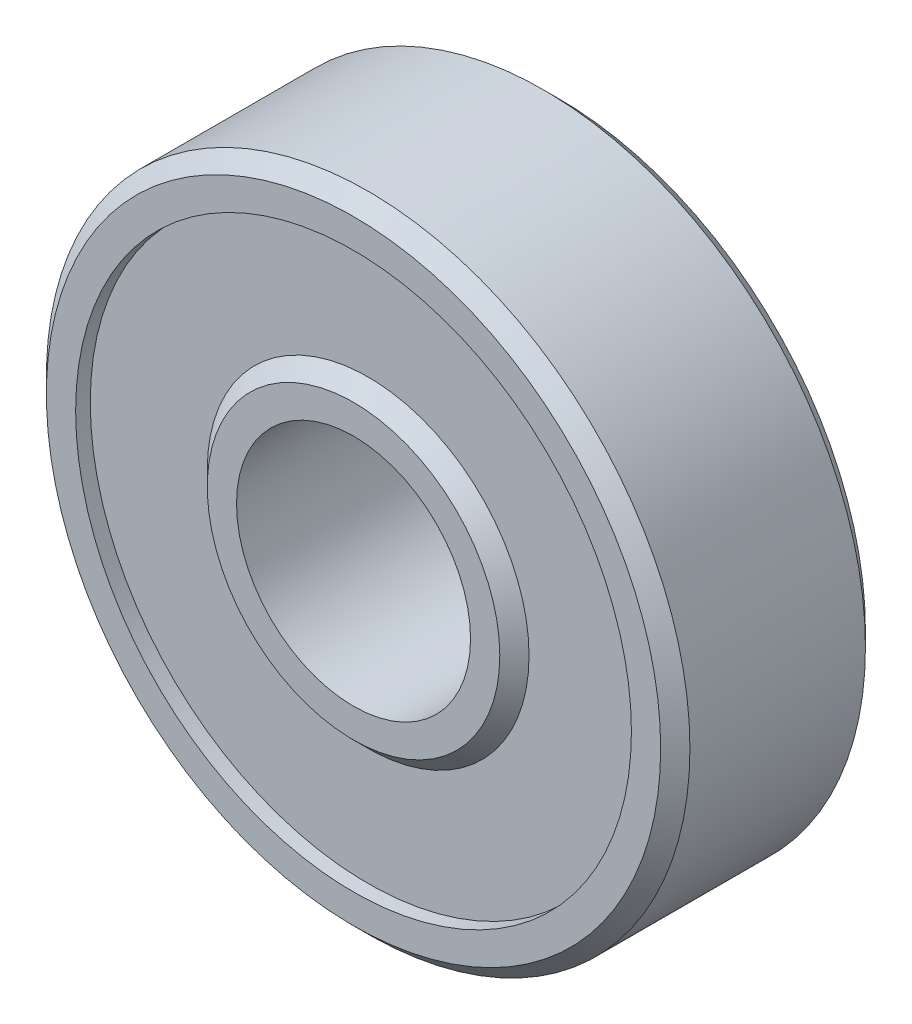
ISO-10303-21;
HEADER;
FILE_DESCRIPTION(('STEP AP214'),'2;1');
FILE_NAME('part.step','',(''),(''),'','','');
FILE_SCHEMA(('AUTOMOTIVE_DESIGN { 1 0 10303 214 1 1 1 1 }'));
ENDSEC;
DATA;
#1=APPLICATION_CONTEXT('core data for automotive mechanical design processes');
#2=APPLICATION_PROTOCOL_DEFINITION('international standard','automotive_design',2000,#1);
#3=PRODUCT_CONTEXT('',#1,'mechanical');
#4=PRODUCT('Part','Part','',(#3));
#5=PRODUCT_RELATED_PRODUCT_CATEGORY('part','',(#4));
#6=PRODUCT_DEFINITION_FORMATION('','',#4);
#7=PRODUCT_DEFINITION_CONTEXT('part definition',#1,'design');
#8=PRODUCT_DEFINITION('design','',#6,#7);
#9=PRODUCT_DEFINITION_SHAPE('','',#8);
#10=(LENGTH_UNIT() NAMED_UNIT(*) SI_UNIT(.MILLI.,.METRE.));
#11=(NAMED_UNIT(*) PLANE_ANGLE_UNIT() SI_UNIT($,.RADIAN.));
#12=(NAMED_UNIT(*) SI_UNIT($,.STERADIAN.) SOLID_ANGLE_UNIT());
#13=UNCERTAINTY_MEASURE_WITH_UNIT(LENGTH_MEASURE(1.E-05),#10,'distance_accuracy_value','');
#14=(GEOMETRIC_REPRESENTATION_CONTEXT(3) GLOBAL_UNCERTAINTY_ASSIGNED_CONTEXT((#13)) GLOBAL_UNIT_ASSIGNED_CONTEXT((#10,
#11,#12)) REPRESENTATION_CONTEXT('',''));
#15=CARTESIAN_POINT('',(0.,0.,0.));
#16=DIRECTION('',(0.,0.,1.));
#17=DIRECTION('',(1.,0.,0.));
#18=AXIS2_PLACEMENT_3D('',#15,#16,#17);
#19=CARTESIAN_POINT('',(0.,0.,3.5));
#20=DIRECTION('',(0.,0.,-1.));
#21=DIRECTION('',(-1.,0.,0.));
#22=AXIS2_PLACEMENT_3D('',#19,#20,#21);
#23=CYLINDRICAL_SURFACE('',#22,9.5);
#24=CARTESIAN_POINT('',(0.,0.,-3.5));
#25=DIRECTION('',(0.,0.,1.));
#26=DIRECTION('',(1.,0.,0.));
#27=AXIS2_PLACEMENT_3D('',#24,#25,#26);
#28=CIRCLE('',#27,9.5);
#29=CARTESIAN_POINT('',(9.5,0.,-3.5));
#30=VERTEX_POINT('',#29);
#31=EDGE_CURVE('E70',#30,#30,#28,.T.);
#32=ORIENTED_EDGE('',*,*,#31,.F.);
#33=EDGE_LOOP('',(#32));
#34=FACE_BOUND('',#33,.T.);
#35=CARTESIAN_POINT('',(0.,0.,-3.));
#36=DIRECTION('',(0.,0.,1.));
#37=DIRECTION('',(1.,0.,0.));
#38=AXIS2_PLACEMENT_3D('',#35,#36,#37);
#39=CIRCLE('',#38,9.5);
#40=CARTESIAN_POINT('',(9.5,0.,-3.));
#41=VERTEX_POINT('',#40);
#42=EDGE_CURVE('E76',#41,#41,#39,.T.);
#43=ORIENTED_EDGE('',*,*,#42,.T.);
#44=EDGE_LOOP('',(#43));
#45=FACE_BOUND('',#44,.T.);
#46=ADVANCED_FACE('F40',(#34,#45),#23,.F.);
#47=CARTESIAN_POINT('',(0.,0.,3.));
#48=DIRECTION('',(0.,0.,1.));
#49=DIRECTION('',(1.,0.,0.));
#50=AXIS2_PLACEMENT_3D('',#47,#48,#49);
#51=CIRCLE('',#50,9.5);
#52=CARTESIAN_POINT('',(9.5,0.,3.));
#53=VERTEX_POINT('',#52);
#54=EDGE_CURVE('E66',#53,#53,#51,.T.);
#55=ORIENTED_EDGE('',*,*,#54,.F.);
#56=EDGE_LOOP('',(#55));
#57=FACE_BOUND('',#56,.T.);
#58=CARTESIAN_POINT('',(0.,0.,3.5));
#59=DIRECTION('',(0.,0.,1.));
#60=DIRECTION('',(1.,0.,0.));
#61=AXIS2_PLACEMENT_3D('',#58,#59,#60);
#62=CIRCLE('',#61,9.5);
#63=CARTESIAN_POINT('',(9.5,0.,3.5));
#64=VERTEX_POINT('',#63);
#65=EDGE_CURVE('E69',#64,#64,#62,.T.);
#66=ORIENTED_EDGE('',*,*,#65,.T.);
#67=EDGE_LOOP('',(#66));
#68=FACE_BOUND('',#67,.T.);
#69=ADVANCED_FACE('F109',(#57,#68),#23,.F.);
#70=CARTESIAN_POINT('',(0.,0.,3.5));
#71=DIRECTION('',(0.,0.,-1.));
#72=DIRECTION('',(-1.,0.,0.));
#73=AXIS2_PLACEMENT_3D('',#70,#71,#72);
#74=CYLINDRICAL_SURFACE('',#73,11.);
#75=CARTESIAN_POINT('',(0.,0.,-3.));
#76=DIRECTION('',(0.,0.,1.));
#77=DIRECTION('',(1.,0.,0.));
#78=AXIS2_PLACEMENT_3D('',#75,#76,#77);
#79=CIRCLE('',#78,11.);
#80=CARTESIAN_POINT('',(11.,0.,-3.));
#81=VERTEX_POINT('',#80);
#82=EDGE_CURVE('E51',#81,#81,#79,.T.);
#83=ORIENTED_EDGE('',*,*,#82,.T.);
#84=EDGE_LOOP('',(#83));
#85=FACE_BOUND('',#84,.T.);
#86=CARTESIAN_POINT('',(0.,0.,3.00000000000001));
#87=DIRECTION('',(0.,0.,1.));
#88=DIRECTION('',(1.,0.,0.));
#89=AXIS2_PLACEMENT_3D('',#86,#87,#88);
#90=CIRCLE('',#89,11.);
#91=CARTESIAN_POINT('',(11.,0.,3.00000000000001));
#92=VERTEX_POINT('',#91);
#93=EDGE_CURVE('E55',#92,#92,#90,.F.);
#94=ORIENTED_EDGE('',*,*,#93,.T.);
#95=EDGE_LOOP('',(#94));
#96=FACE_BOUND('',#95,.T.);
#97=ADVANCED_FACE('F115',(#85,#96),#74,.T.);
#98=CARTESIAN_POINT('',(0.,0.,3.5));
#99=DIRECTION('',(0.,0.,1.));
#100=DIRECTION('',(1.,0.,0.));
#101=AXIS2_PLACEMENT_3D('',#98,#99,#100);
#102=PLANE('',#101);
#103=CARTESIAN_POINT('',(0.,0.,3.5));
#104=DIRECTION('',(0.,0.,1.));
#105=DIRECTION('',(1.,0.,0.));
#106=AXIS2_PLACEMENT_3D('',#103,#104,#105);
#107=CIRCLE('',#106,10.5);
#108=CARTESIAN_POINT('',(10.5,0.,3.5));
#109=VERTEX_POINT('',#108);
#110=EDGE_CURVE('E11',#109,#109,#107,.T.);
#111=ORIENTED_EDGE('',*,*,#110,.T.);
#112=EDGE_LOOP('',(#111));
#113=FACE_BOUND('',#112,.T.);
#114=ORIENTED_EDGE('',*,*,#65,.F.);
#115=EDGE_LOOP('',(#114));
#116=FACE_BOUND('',#115,.T.);
#117=ADVANCED_FACE('F140',(#113,#116),#102,.T.);
#118=CARTESIAN_POINT('',(0.,0.,-3.5));
#119=DIRECTION('',(0.,0.,1.));
#120=DIRECTION('',(1.,0.,0.));
#121=AXIS2_PLACEMENT_3D('',#118,#119,#120);
#122=PLANE('',#121);
#123=CARTESIAN_POINT('',(0.,0.,-3.5));
#124=DIRECTION('',(0.,0.,1.));
#125=DIRECTION('',(1.,0.,0.));
#126=AXIS2_PLACEMENT_3D('',#123,#124,#125);
#127=CIRCLE('',#126,10.5);
#128=CARTESIAN_POINT('',(10.5,0.,-3.5));
#129=VERTEX_POINT('',#128);
#130=EDGE_CURVE('E47',#129,#129,#127,.F.);
#131=ORIENTED_EDGE('',*,*,#130,.T.);
#132=EDGE_LOOP('',(#131));
#133=FACE_BOUND('',#132,.T.);
#134=ORIENTED_EDGE('',*,*,#31,.T.);
#135=EDGE_LOOP('',(#134));
#136=FACE_BOUND('',#135,.T.);
#137=ADVANCED_FACE('F146',(#133,#136),#122,.F.);
#138=CARTESIAN_POINT('',(0.,0.,3.));
#139=DIRECTION('',(0.,0.,1.));
#140=DIRECTION('',(1.,0.,0.));
#141=AXIS2_PLACEMENT_3D('',#138,#139,#140);
#142=PLANE('',#141);
#143=CARTESIAN_POINT('',(0.,0.,3.));
#144=DIRECTION('',(0.,0.,1.));
#145=DIRECTION('',(1.,0.,0.));
#146=AXIS2_PLACEMENT_3D('',#143,#144,#145);
#147=CIRCLE('',#146,5.5);
#148=CARTESIAN_POINT('',(5.5,0.,3.));
#149=VERTEX_POINT('',#148);
#150=EDGE_CURVE('E73',#149,#149,#147,.T.);
#151=ORIENTED_EDGE('',*,*,#150,.F.);
#152=EDGE_LOOP('',(#151));
#153=FACE_BOUND('',#152,.T.);
#154=ORIENTED_EDGE('',*,*,#54,.T.);
#155=EDGE_LOOP('',(#154));
#156=FACE_BOUND('',#155,.T.);
#157=ADVANCED_FACE('F151',(#153,#156),#142,.T.);
#158=CARTESIAN_POINT('',(0.,0.,-3.));
#159=DIRECTION('',(0.,0.,1.));
#160=DIRECTION('',(1.,0.,0.));
#161=AXIS2_PLACEMENT_3D('',#158,#159,#160);
#162=PLANE('',#161);
#163=CARTESIAN_POINT('',(0.,0.,-3.));
#164=DIRECTION('',(0.,0.,1.));
#165=DIRECTION('',(1.,0.,0.));
#166=AXIS2_PLACEMENT_3D('',#163,#164,#165);
#167=CIRCLE('',#166,5.5);
#168=CARTESIAN_POINT('',(5.5,0.,-3.));
#169=VERTEX_POINT('',#168);
#170=EDGE_CURVE('E79',#169,#169,#167,.F.);
#171=ORIENTED_EDGE('',*,*,#170,.F.);
#172=EDGE_LOOP('',(#171));
#173=FACE_BOUND('',#172,.T.);
#174=ORIENTED_EDGE('',*,*,#42,.F.);
#175=EDGE_LOOP('',(#174));
#176=FACE_BOUND('',#175,.T.);
#177=ADVANCED_FACE('F106',(#173,#176),#162,.F.);
#178=CARTESIAN_POINT('',(0.,0.,3.5));
#179=DIRECTION('',(0.,0.,-1.));
#180=DIRECTION('',(-1.,0.,0.));
#181=AXIS2_PLACEMENT_3D('',#178,#179,#180);
#182=CYLINDRICAL_SURFACE('',#181,4.);
#183=CARTESIAN_POINT('',(0.,0.,3.5));
#184=DIRECTION('',(0.,0.,1.));
#185=DIRECTION('',(1.,0.,0.));
#186=AXIS2_PLACEMENT_3D('',#183,#184,#185);
#187=CIRCLE('',#186,4.);
#188=CARTESIAN_POINT('',(4.,0.,3.5));
#189=VERTEX_POINT('',#188);
#190=EDGE_CURVE('E84',#189,#189,#187,.T.);
#191=ORIENTED_EDGE('',*,*,#190,.T.);
#192=EDGE_LOOP('',(#191));
#193=FACE_BOUND('',#192,.T.);
#194=CARTESIAN_POINT('',(0.,0.,-3.5));
#195=DIRECTION('',(0.,0.,1.));
#196=DIRECTION('',(1.,0.,0.));
#197=AXIS2_PLACEMENT_3D('',#194,#195,#196);
#198=CIRCLE('',#197,4.);
#199=CARTESIAN_POINT('',(4.,0.,-3.5));
#200=VERTEX_POINT('',#199);
#201=EDGE_CURVE('E85',#200,#200,#198,.T.);
#202=ORIENTED_EDGE('',*,*,#201,.F.);
#203=EDGE_LOOP('',(#202));
#204=FACE_BOUND('',#203,.T.);
#205=ADVANCED_FACE('F91',(#193,#204),#182,.F.);
#206=CARTESIAN_POINT('',(0.,0.,3.5));
#207=DIRECTION('',(0.,0.,1.));
#208=DIRECTION('',(1.,0.,0.));
#209=AXIS2_PLACEMENT_3D('',#206,#207,#208);
#210=PLANE('',#209);
#211=CARTESIAN_POINT('',(0.,0.,3.5));
#212=DIRECTION('',(0.,0.,1.));
#213=DIRECTION('',(1.,0.,0.));
#214=AXIS2_PLACEMENT_3D('',#211,#212,#213);
#215=CIRCLE('',#214,5.);
#216=CARTESIAN_POINT('',(5.,0.,3.5));
#217=VERTEX_POINT('',#216);
#218=EDGE_CURVE('E63',#217,#217,#215,.T.);
#219=ORIENTED_EDGE('',*,*,#218,.T.);
#220=EDGE_LOOP('',(#219));
#221=FACE_BOUND('',#220,.T.);
#222=ORIENTED_EDGE('',*,*,#190,.F.);
#223=EDGE_LOOP('',(#222));
#224=FACE_BOUND('',#223,.T.);
#225=ADVANCED_FACE('F94',(#221,#224),#210,.T.);
#226=CARTESIAN_POINT('',(0.,0.,-3.5));
#227=DIRECTION('',(0.,0.,1.));
#228=DIRECTION('',(1.,0.,0.));
#229=AXIS2_PLACEMENT_3D('',#226,#227,#228);
#230=PLANE('',#229);
#231=CARTESIAN_POINT('',(0.,0.,-3.5));
#232=DIRECTION('',(0.,0.,1.));
#233=DIRECTION('',(1.,0.,0.));
#234=AXIS2_PLACEMENT_3D('',#231,#232,#233);
#235=CIRCLE('',#234,5.);
#236=CARTESIAN_POINT('',(5.,0.,-3.5));
#237=VERTEX_POINT('',#236);
#238=EDGE_CURVE('E60',#237,#237,#235,.F.);
#239=ORIENTED_EDGE('',*,*,#238,.T.);
#240=EDGE_LOOP('',(#239));
#241=FACE_BOUND('',#240,.T.);
#242=ORIENTED_EDGE('',*,*,#201,.T.);
#243=EDGE_LOOP('',(#242));
#244=FACE_BOUND('',#243,.T.);
#245=ADVANCED_FACE('F96',(#241,#244),#230,.F.);
#246=CARTESIAN_POINT('',(0.,0.,3.5));
#247=DIRECTION('',(0.,0.,-1.));
#248=DIRECTION('',(-1.,0.,0.));
#249=AXIS2_PLACEMENT_3D('',#246,#247,#248);
#250=CONICAL_SURFACE('',#249,5.,0.785398163397447);
#251=ORIENTED_EDGE('',*,*,#150,.T.);
#252=EDGE_LOOP('',(#251));
#253=FACE_BOUND('',#252,.T.);
#254=ORIENTED_EDGE('',*,*,#218,.F.);
#255=EDGE_LOOP('',(#254));
#256=FACE_BOUND('',#255,.T.);
#257=ADVANCED_FACE('F103',(#253,#256),#250,.T.);
#258=CARTESIAN_POINT('',(0.,0.,-3.));
#259=DIRECTION('',(0.,0.,1.));
#260=DIRECTION('',(1.,0.,0.));
#261=AXIS2_PLACEMENT_3D('',#258,#259,#260);
#262=CONICAL_SURFACE('',#261,5.5,0.78539816339745);
#263=ORIENTED_EDGE('',*,*,#238,.F.);
#264=EDGE_LOOP('',(#263));
#265=FACE_BOUND('',#264,.T.);
#266=ORIENTED_EDGE('',*,*,#170,.T.);
#267=EDGE_LOOP('',(#266));
#268=FACE_BOUND('',#267,.T.);
#269=ADVANCED_FACE('F124',(#265,#268),#262,.T.);
#270=CARTESIAN_POINT('',(0.,0.,-3.));
#271=DIRECTION('',(0.,0.,1.));
#272=DIRECTION('',(1.,0.,0.));
#273=AXIS2_PLACEMENT_3D('',#270,#271,#272);
#274=CONICAL_SURFACE('',#273,11.,0.785398163397452);
#275=ORIENTED_EDGE('',*,*,#130,.F.);
#276=EDGE_LOOP('',(#275));
#277=FACE_BOUND('',#276,.T.);
#278=ORIENTED_EDGE('',*,*,#82,.F.);
#279=EDGE_LOOP('',(#278));
#280=FACE_BOUND('',#279,.T.);
#281=ADVANCED_FACE('F127',(#277,#280),#274,.T.);
#282=CARTESIAN_POINT('',(0.,0.,3.5));
#283=DIRECTION('',(0.,0.,-1.));
#284=DIRECTION('',(-1.,0.,0.));
#285=AXIS2_PLACEMENT_3D('',#282,#283,#284);
#286=CONICAL_SURFACE('',#285,10.5,0.785398163397448);
#287=ORIENTED_EDGE('',*,*,#93,.F.);
#288=EDGE_LOOP('',(#287));
#289=FACE_BOUND('',#288,.T.);
#290=ORIENTED_EDGE('',*,*,#110,.F.);
#291=EDGE_LOOP('',(#290));
#292=FACE_BOUND('',#291,.T.);
#293=ADVANCED_FACE('F42',(#289,#292),#286,.T.);
#294=CLOSED_SHELL('',(#46,#69,#97,#117,#137,#157,#177,#205,#225,#245,#257,#269,#281,#293));
#295=MANIFOLD_SOLID_BREP('B2',#294);
#296=ADVANCED_BREP_SHAPE_REPRESENTATION('',(#18,#295),#14);
#297=SHAPE_DEFINITION_REPRESENTATION(#9,#296);
ENDSEC;
END-ISO-10303-21;
